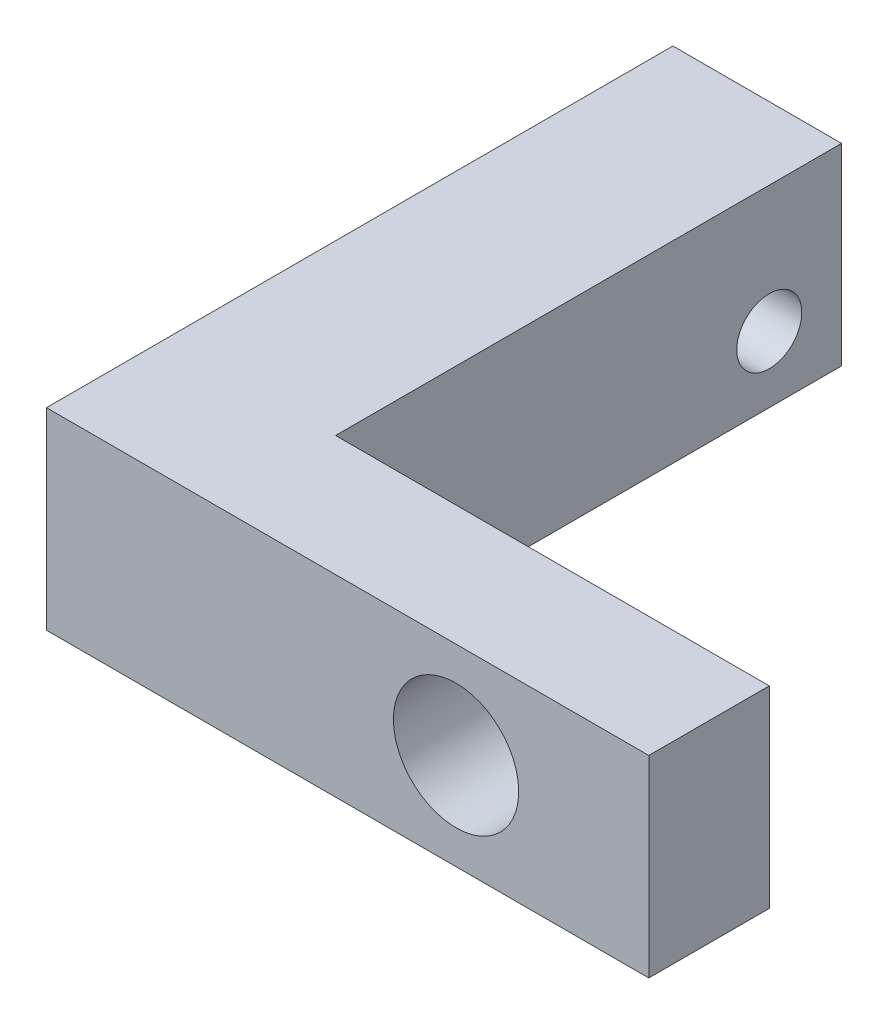
ISO-10303-21;
HEADER;
FILE_DESCRIPTION(('STEP AP214'),'2;1');
FILE_NAME('part.step','',(''),(''),'','','');
FILE_SCHEMA(('AUTOMOTIVE_DESIGN { 1 0 10303 214 1 1 1 1 }'));
ENDSEC;
DATA;
#1=APPLICATION_CONTEXT('core data for automotive mechanical design processes');
#2=APPLICATION_PROTOCOL_DEFINITION('international standard','automotive_design',2000,#1);
#3=PRODUCT_CONTEXT('',#1,'mechanical');
#4=PRODUCT('Part','Part','',(#3));
#5=PRODUCT_RELATED_PRODUCT_CATEGORY('part','',(#4));
#6=PRODUCT_DEFINITION_FORMATION('','',#4);
#7=PRODUCT_DEFINITION_CONTEXT('part definition',#1,'design');
#8=PRODUCT_DEFINITION('design','',#6,#7);
#9=PRODUCT_DEFINITION_SHAPE('','',#8);
#10=(LENGTH_UNIT() NAMED_UNIT(*) SI_UNIT(.MILLI.,.METRE.));
#11=(NAMED_UNIT(*) PLANE_ANGLE_UNIT() SI_UNIT($,.RADIAN.));
#12=(NAMED_UNIT(*) SI_UNIT($,.STERADIAN.) SOLID_ANGLE_UNIT());
#13=UNCERTAINTY_MEASURE_WITH_UNIT(LENGTH_MEASURE(1.E-05),#10,'distance_accuracy_value','');
#14=(GEOMETRIC_REPRESENTATION_CONTEXT(3) GLOBAL_UNCERTAINTY_ASSIGNED_CONTEXT((#13)) GLOBAL_UNIT_ASSIGNED_CONTEXT((#10,
#11,#12)) REPRESENTATION_CONTEXT('',''));
#15=CARTESIAN_POINT('',(0.,0.,0.));
#16=DIRECTION('',(0.,0.,1.));
#17=DIRECTION('',(1.,0.,0.));
#18=AXIS2_PLACEMENT_3D('',#15,#16,#17);
#19=CARTESIAN_POINT('',(25.,8.,0.));
#20=DIRECTION('',(0.,0.,-1.));
#21=DIRECTION('',(-1.,0.,0.));
#22=AXIS2_PLACEMENT_3D('',#19,#20,#21);
#23=PLANE('',#22);
#24=CARTESIAN_POINT('',(17.,4.,0.));
#25=DIRECTION('',(0.,0.,-1.));
#26=DIRECTION('',(-1.,0.,0.));
#27=AXIS2_PLACEMENT_3D('',#24,#25,#26);
#28=CIRCLE('',#27,2.6);
#29=CARTESIAN_POINT('',(14.4,4.,0.));
#30=VERTEX_POINT('',#29);
#31=EDGE_CURVE('E162',#30,#30,#28,.F.);
#32=ORIENTED_EDGE('',*,*,#31,.F.);
#33=EDGE_LOOP('',(#32));
#34=FACE_BOUND('',#33,.T.);
#35=DIRECTION('',(1.,0.,0.));
#36=VECTOR('',#35,1.);
#37=CARTESIAN_POINT('',(25.,0.,0.));
#38=LINE('',#37,#36);
#39=CARTESIAN_POINT('',(0.,0.,0.));
#40=VERTEX_POINT('',#39);
#41=CARTESIAN_POINT('',(25.,0.,0.));
#42=VERTEX_POINT('',#41);
#43=EDGE_CURVE('E117',#40,#42,#38,.T.);
#44=ORIENTED_EDGE('',*,*,#43,.T.);
#45=DIRECTION('',(0.,-1.,0.));
#46=VECTOR('',#45,1.);
#47=CARTESIAN_POINT('',(25.,8.,0.));
#48=LINE('',#47,#46);
#49=CARTESIAN_POINT('',(25.,8.,0.));
#50=VERTEX_POINT('',#49);
#51=EDGE_CURVE('E11',#50,#42,#48,.T.);
#52=ORIENTED_EDGE('',*,*,#51,.F.);
#53=DIRECTION('',(1.,0.,0.));
#54=VECTOR('',#53,1.);
#55=CARTESIAN_POINT('',(25.,8.,0.));
#56=LINE('',#55,#54);
#57=CARTESIAN_POINT('',(0.,8.,0.));
#58=VERTEX_POINT('',#57);
#59=EDGE_CURVE('E128',#58,#50,#56,.T.);
#60=ORIENTED_EDGE('',*,*,#59,.F.);
#61=DIRECTION('',(0.,-1.,0.));
#62=VECTOR('',#61,1.);
#63=CARTESIAN_POINT('',(0.,8.,0.));
#64=LINE('',#63,#62);
#65=EDGE_CURVE('E113',#58,#40,#64,.T.);
#66=ORIENTED_EDGE('',*,*,#65,.T.);
#67=EDGE_LOOP('',(#44,#52,#60,#66));
#68=FACE_BOUND('',#67,.T.);
#69=ADVANCED_FACE('F33',(#34,#68),#23,.F.);
#70=CARTESIAN_POINT('',(25.,8.,-5.));
#71=DIRECTION('',(-1.,0.,0.));
#72=DIRECTION('',(0.,0.,1.));
#73=AXIS2_PLACEMENT_3D('',#70,#71,#72);
#74=PLANE('',#73);
#75=DIRECTION('',(0.,0.,-1.));
#76=VECTOR('',#75,1.);
#77=CARTESIAN_POINT('',(25.,0.,-5.));
#78=LINE('',#77,#76);
#79=CARTESIAN_POINT('',(25.,0.,-5.));
#80=VERTEX_POINT('',#79);
#81=EDGE_CURVE('E120',#42,#80,#78,.T.);
#82=ORIENTED_EDGE('',*,*,#81,.T.);
#83=DIRECTION('',(0.,-1.,0.));
#84=VECTOR('',#83,1.);
#85=CARTESIAN_POINT('',(25.,8.,-5.));
#86=LINE('',#85,#84);
#87=CARTESIAN_POINT('',(25.,8.,-5.));
#88=VERTEX_POINT('',#87);
#89=EDGE_CURVE('E41',#88,#80,#86,.T.);
#90=ORIENTED_EDGE('',*,*,#89,.F.);
#91=DIRECTION('',(0.,0.,-1.));
#92=VECTOR('',#91,1.);
#93=CARTESIAN_POINT('',(25.,8.,-5.));
#94=LINE('',#93,#92);
#95=EDGE_CURVE('E86',#50,#88,#94,.T.);
#96=ORIENTED_EDGE('',*,*,#95,.F.);
#97=ORIENTED_EDGE('',*,*,#51,.T.);
#98=EDGE_LOOP('',(#82,#90,#96,#97));
#99=FACE_BOUND('',#98,.T.);
#100=ADVANCED_FACE('F155',(#99),#74,.F.);
#101=CARTESIAN_POINT('',(7.,8.,-5.));
#102=DIRECTION('',(0.,0.,1.));
#103=DIRECTION('',(1.,0.,0.));
#104=AXIS2_PLACEMENT_3D('',#101,#102,#103);
#105=PLANE('',#104);
#106=CARTESIAN_POINT('',(17.,4.,-5.));
#107=DIRECTION('',(0.,0.,-1.));
#108=DIRECTION('',(-1.,0.,0.));
#109=AXIS2_PLACEMENT_3D('',#106,#107,#108);
#110=CIRCLE('',#109,2.6);
#111=CARTESIAN_POINT('',(14.4,4.,-5.));
#112=VERTEX_POINT('',#111);
#113=EDGE_CURVE('E165',#112,#112,#110,.T.);
#114=ORIENTED_EDGE('',*,*,#113,.F.);
#115=EDGE_LOOP('',(#114));
#116=FACE_BOUND('',#115,.T.);
#117=DIRECTION('',(-1.,0.,0.));
#118=VECTOR('',#117,1.);
#119=CARTESIAN_POINT('',(7.,0.,-5.));
#120=LINE('',#119,#118);
#121=CARTESIAN_POINT('',(7.,0.,-5.));
#122=VERTEX_POINT('',#121);
#123=EDGE_CURVE('E123',#80,#122,#120,.T.);
#124=ORIENTED_EDGE('',*,*,#123,.T.);
#125=DIRECTION('',(0.,-1.,0.));
#126=VECTOR('',#125,1.);
#127=CARTESIAN_POINT('',(7.,8.,-5.));
#128=LINE('',#127,#126);
#129=CARTESIAN_POINT('',(7.,8.,-5.));
#130=VERTEX_POINT('',#129);
#131=EDGE_CURVE('E108',#130,#122,#128,.T.);
#132=ORIENTED_EDGE('',*,*,#131,.F.);
#133=DIRECTION('',(-1.,0.,0.));
#134=VECTOR('',#133,1.);
#135=CARTESIAN_POINT('',(7.,8.,-5.));
#136=LINE('',#135,#134);
#137=EDGE_CURVE('E99',#88,#130,#136,.T.);
#138=ORIENTED_EDGE('',*,*,#137,.F.);
#139=ORIENTED_EDGE('',*,*,#89,.T.);
#140=EDGE_LOOP('',(#124,#132,#138,#139));
#141=FACE_BOUND('',#140,.T.);
#142=ADVANCED_FACE('F134',(#116,#141),#105,.F.);
#143=CARTESIAN_POINT('',(7.,8.,-26.));
#144=DIRECTION('',(-1.,0.,0.));
#145=DIRECTION('',(0.,0.,1.));
#146=AXIS2_PLACEMENT_3D('',#143,#144,#145);
#147=PLANE('',#146);
#148=CARTESIAN_POINT('',(7.,2.75,-23.));
#149=DIRECTION('',(-1.,0.,0.));
#150=DIRECTION('',(0.,0.,1.));
#151=AXIS2_PLACEMENT_3D('',#148,#149,#150);
#152=CIRCLE('',#151,1.35000000000001);
#153=CARTESIAN_POINT('',(7.,2.75,-21.65));
#154=VERTEX_POINT('',#153);
#155=EDGE_CURVE('E121',#154,#154,#152,.T.);
#156=ORIENTED_EDGE('',*,*,#155,.T.);
#157=EDGE_LOOP('',(#156));
#158=FACE_BOUND('',#157,.T.);
#159=DIRECTION('',(0.,0.,-1.));
#160=VECTOR('',#159,1.);
#161=CARTESIAN_POINT('',(7.,0.,-26.));
#162=LINE('',#161,#160);
#163=CARTESIAN_POINT('',(7.,0.,-26.));
#164=VERTEX_POINT('',#163);
#165=EDGE_CURVE('E107',#122,#164,#162,.T.);
#166=ORIENTED_EDGE('',*,*,#165,.T.);
#167=DIRECTION('',(0.,-1.,0.));
#168=VECTOR('',#167,1.);
#169=CARTESIAN_POINT('',(7.,8.,-26.));
#170=LINE('',#169,#168);
#171=CARTESIAN_POINT('',(7.,8.,-26.));
#172=VERTEX_POINT('',#171);
#173=EDGE_CURVE('E104',#172,#164,#170,.T.);
#174=ORIENTED_EDGE('',*,*,#173,.F.);
#175=DIRECTION('',(0.,0.,-1.));
#176=VECTOR('',#175,1.);
#177=CARTESIAN_POINT('',(7.,8.,-26.));
#178=LINE('',#177,#176);
#179=EDGE_CURVE('E93',#130,#172,#178,.T.);
#180=ORIENTED_EDGE('',*,*,#179,.F.);
#181=ORIENTED_EDGE('',*,*,#131,.T.);
#182=EDGE_LOOP('',(#166,#174,#180,#181));
#183=FACE_BOUND('',#182,.T.);
#184=ADVANCED_FACE('F105',(#158,#183),#147,.F.);
#185=CARTESIAN_POINT('',(0.,8.,-26.));
#186=DIRECTION('',(0.,0.,1.));
#187=DIRECTION('',(1.,0.,0.));
#188=AXIS2_PLACEMENT_3D('',#185,#186,#187);
#189=PLANE('',#188);
#190=DIRECTION('',(-1.,0.,0.));
#191=VECTOR('',#190,1.);
#192=CARTESIAN_POINT('',(0.,0.,-26.));
#193=LINE('',#192,#191);
#194=CARTESIAN_POINT('',(0.,0.,-26.));
#195=VERTEX_POINT('',#194);
#196=EDGE_CURVE('E72',#164,#195,#193,.T.);
#197=ORIENTED_EDGE('',*,*,#196,.T.);
#198=DIRECTION('',(0.,-1.,0.));
#199=VECTOR('',#198,1.);
#200=CARTESIAN_POINT('',(0.,8.,-26.));
#201=LINE('',#200,#199);
#202=CARTESIAN_POINT('',(0.,8.,-26.));
#203=VERTEX_POINT('',#202);
#204=EDGE_CURVE('E109',#203,#195,#201,.T.);
#205=ORIENTED_EDGE('',*,*,#204,.F.);
#206=DIRECTION('',(-1.,0.,0.));
#207=VECTOR('',#206,1.);
#208=CARTESIAN_POINT('',(0.,8.,-26.));
#209=LINE('',#208,#207);
#210=EDGE_CURVE('E97',#172,#203,#209,.T.);
#211=ORIENTED_EDGE('',*,*,#210,.F.);
#212=ORIENTED_EDGE('',*,*,#173,.T.);
#213=EDGE_LOOP('',(#197,#205,#211,#212));
#214=FACE_BOUND('',#213,.T.);
#215=ADVANCED_FACE('F111',(#214),#189,.F.);
#216=CARTESIAN_POINT('',(0.,8.,0.));
#217=DIRECTION('',(1.,0.,0.));
#218=DIRECTION('',(0.,0.,-1.));
#219=AXIS2_PLACEMENT_3D('',#216,#217,#218);
#220=PLANE('',#219);
#221=CARTESIAN_POINT('',(0.,2.75,-3.5));
#222=DIRECTION('',(-1.,0.,0.));
#223=DIRECTION('',(0.,0.,1.));
#224=AXIS2_PLACEMENT_3D('',#221,#222,#223);
#225=CIRCLE('',#224,1.35);
#226=CARTESIAN_POINT('',(0.,2.75,-2.15));
#227=VERTEX_POINT('',#226);
#228=EDGE_CURVE('E164',#227,#227,#225,.T.);
#229=ORIENTED_EDGE('',*,*,#228,.F.);
#230=EDGE_LOOP('',(#229));
#231=FACE_BOUND('',#230,.T.);
#232=CARTESIAN_POINT('',(0.,2.75,-23.));
#233=DIRECTION('',(-1.,0.,0.));
#234=DIRECTION('',(0.,0.,1.));
#235=AXIS2_PLACEMENT_3D('',#232,#233,#234);
#236=CIRCLE('',#235,1.35000000000001);
#237=CARTESIAN_POINT('',(0.,2.75,-21.65));
#238=VERTEX_POINT('',#237);
#239=EDGE_CURVE('E174',#238,#238,#236,.T.);
#240=ORIENTED_EDGE('',*,*,#239,.F.);
#241=EDGE_LOOP('',(#240));
#242=FACE_BOUND('',#241,.T.);
#243=DIRECTION('',(0.,0.,1.));
#244=VECTOR('',#243,1.);
#245=CARTESIAN_POINT('',(0.,0.,0.));
#246=LINE('',#245,#244);
#247=EDGE_CURVE('E78',#195,#40,#246,.T.);
#248=ORIENTED_EDGE('',*,*,#247,.T.);
#249=ORIENTED_EDGE('',*,*,#65,.F.);
#250=DIRECTION('',(0.,0.,1.));
#251=VECTOR('',#250,1.);
#252=CARTESIAN_POINT('',(0.,8.,0.));
#253=LINE('',#252,#251);
#254=EDGE_CURVE('E49',#203,#58,#253,.T.);
#255=ORIENTED_EDGE('',*,*,#254,.F.);
#256=ORIENTED_EDGE('',*,*,#204,.T.);
#257=EDGE_LOOP('',(#248,#249,#255,#256));
#258=FACE_BOUND('',#257,.T.);
#259=ADVANCED_FACE('F141',(#231,#242,#258),#220,.F.);
#260=CARTESIAN_POINT('',(0.,8.,0.));
#261=DIRECTION('',(0.,-1.,0.));
#262=DIRECTION('',(0.,0.,-1.));
#263=AXIS2_PLACEMENT_3D('',#260,#261,#262);
#264=PLANE('',#263);
#265=ORIENTED_EDGE('',*,*,#59,.T.);
#266=ORIENTED_EDGE('',*,*,#95,.T.);
#267=ORIENTED_EDGE('',*,*,#137,.T.);
#268=ORIENTED_EDGE('',*,*,#179,.T.);
#269=ORIENTED_EDGE('',*,*,#210,.T.);
#270=ORIENTED_EDGE('',*,*,#254,.T.);
#271=EDGE_LOOP('',(#265,#266,#267,#268,#269,#270));
#272=FACE_BOUND('',#271,.T.);
#273=ADVANCED_FACE('F95',(#272),#264,.F.);
#274=CARTESIAN_POINT('',(0.,0.,0.));
#275=DIRECTION('',(0.,-1.,0.));
#276=DIRECTION('',(0.,0.,-1.));
#277=AXIS2_PLACEMENT_3D('',#274,#275,#276);
#278=PLANE('',#277);
#279=ORIENTED_EDGE('',*,*,#43,.F.);
#280=ORIENTED_EDGE('',*,*,#247,.F.);
#281=ORIENTED_EDGE('',*,*,#196,.F.);
#282=ORIENTED_EDGE('',*,*,#165,.F.);
#283=ORIENTED_EDGE('',*,*,#123,.F.);
#284=ORIENTED_EDGE('',*,*,#81,.F.);
#285=EDGE_LOOP('',(#279,#280,#281,#282,#283,#284));
#286=FACE_BOUND('',#285,.T.);
#287=ADVANCED_FACE('F137',(#286),#278,.T.);
#288=CARTESIAN_POINT('',(10.,2.75,-23.));
#289=DIRECTION('',(-1.,0.,0.));
#290=DIRECTION('',(0.,0.,1.));
#291=AXIS2_PLACEMENT_3D('',#288,#289,#290);
#292=CYLINDRICAL_SURFACE('',#291,1.35000000000001);
#293=ORIENTED_EDGE('',*,*,#239,.T.);
#294=EDGE_LOOP('',(#293));
#295=FACE_BOUND('',#294,.T.);
#296=ORIENTED_EDGE('',*,*,#155,.F.);
#297=EDGE_LOOP('',(#296));
#298=FACE_BOUND('',#297,.T.);
#299=ADVANCED_FACE('F184',(#295,#298),#292,.F.);
#300=CARTESIAN_POINT('',(10.,2.75,-3.5));
#301=DIRECTION('',(-1.,0.,0.));
#302=DIRECTION('',(0.,0.,1.));
#303=AXIS2_PLACEMENT_3D('',#300,#301,#302);
#304=CYLINDRICAL_SURFACE('',#303,1.35);
#305=CARTESIAN_POINT('',(10.,2.75,-3.5));
#306=DIRECTION('',(-1.,0.,0.));
#307=DIRECTION('',(0.,0.,1.));
#308=AXIS2_PLACEMENT_3D('',#305,#306,#307);
#309=CIRCLE('',#308,1.35);
#310=CARTESIAN_POINT('',(10.,2.75,-2.15));
#311=VERTEX_POINT('',#310);
#312=EDGE_CURVE('E168',#311,#311,#309,.T.);
#313=ORIENTED_EDGE('',*,*,#312,.F.);
#314=EDGE_LOOP('',(#313));
#315=FACE_BOUND('',#314,.T.);
#316=ORIENTED_EDGE('',*,*,#228,.T.);
#317=EDGE_LOOP('',(#316));
#318=FACE_BOUND('',#317,.T.);
#319=ADVANCED_FACE('F186',(#315,#318),#304,.F.);
#320=CARTESIAN_POINT('',(10.,2.75,-3.5));
#321=DIRECTION('',(-1.,0.,0.));
#322=DIRECTION('',(0.,0.,1.));
#323=AXIS2_PLACEMENT_3D('',#320,#321,#322);
#324=PLANE('',#323);
#325=ORIENTED_EDGE('',*,*,#312,.T.);
#326=EDGE_LOOP('',(#325));
#327=FACE_BOUND('',#326,.T.);
#328=ADVANCED_FACE('F193',(#327),#324,.T.);
#329=CARTESIAN_POINT('',(17.,4.,0.00100000000000013));
#330=DIRECTION('',(0.,0.,-1.));
#331=DIRECTION('',(-1.,0.,0.));
#332=AXIS2_PLACEMENT_3D('',#329,#330,#331);
#333=CYLINDRICAL_SURFACE('',#332,2.6);
#334=ORIENTED_EDGE('',*,*,#113,.T.);
#335=EDGE_LOOP('',(#334));
#336=FACE_BOUND('',#335,.T.);
#337=ORIENTED_EDGE('',*,*,#31,.T.);
#338=EDGE_LOOP('',(#337));
#339=FACE_BOUND('',#338,.T.);
#340=ADVANCED_FACE('F199',(#336,#339),#333,.F.);
#341=CLOSED_SHELL('',(#69,#100,#142,#184,#215,#259,#273,#287,#299,#319,#328,#340));
#342=MANIFOLD_SOLID_BREP('B2',#341);
#343=ADVANCED_BREP_SHAPE_REPRESENTATION('',(#18,#342),#14);
#344=SHAPE_DEFINITION_REPRESENTATION(#9,#343);
ENDSEC;
END-ISO-10303-21;
